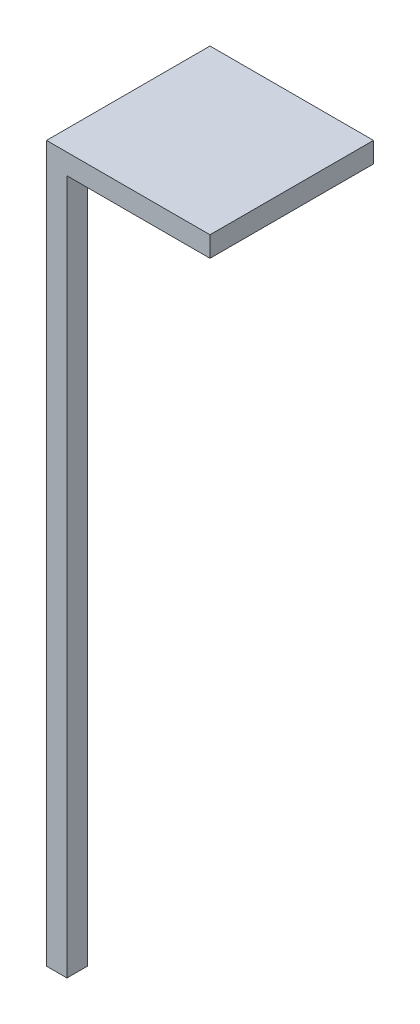
ISO-10303-21;
HEADER;
FILE_DESCRIPTION(('STEP AP214'),'2;1');
FILE_NAME('part.step','',(''),(''),'','','');
FILE_SCHEMA(('AUTOMOTIVE_DESIGN { 1 0 10303 214 1 1 1 1 }'));
ENDSEC;
DATA;
#1=APPLICATION_CONTEXT('core data for automotive mechanical design processes');
#2=APPLICATION_PROTOCOL_DEFINITION('international standard','automotive_design',2000,#1);
#3=PRODUCT_CONTEXT('',#1,'mechanical');
#4=PRODUCT('Part','Part','',(#3));
#5=PRODUCT_RELATED_PRODUCT_CATEGORY('part','',(#4));
#6=PRODUCT_DEFINITION_FORMATION('','',#4);
#7=PRODUCT_DEFINITION_CONTEXT('part definition',#1,'design');
#8=PRODUCT_DEFINITION('design','',#6,#7);
#9=PRODUCT_DEFINITION_SHAPE('','',#8);
#10=(LENGTH_UNIT() NAMED_UNIT(*) SI_UNIT(.MILLI.,.METRE.));
#11=(NAMED_UNIT(*) PLANE_ANGLE_UNIT() SI_UNIT($,.RADIAN.));
#12=(NAMED_UNIT(*) SI_UNIT($,.STERADIAN.) SOLID_ANGLE_UNIT());
#13=UNCERTAINTY_MEASURE_WITH_UNIT(LENGTH_MEASURE(1.E-05),#10,'distance_accuracy_value','');
#14=(GEOMETRIC_REPRESENTATION_CONTEXT(3) GLOBAL_UNCERTAINTY_ASSIGNED_CONTEXT((#13)) GLOBAL_UNIT_ASSIGNED_CONTEXT((#10,
#11,#12)) REPRESENTATION_CONTEXT('',''));
#15=CARTESIAN_POINT('',(0.,0.,0.));
#16=DIRECTION('',(0.,0.,1.));
#17=DIRECTION('',(1.,0.,0.));
#18=AXIS2_PLACEMENT_3D('',#15,#16,#17);
#19=CARTESIAN_POINT('',(0.,340.,0.));
#20=DIRECTION('',(1.,0.,0.));
#21=DIRECTION('',(0.,0.,-1.));
#22=AXIS2_PLACEMENT_3D('',#19,#20,#21);
#23=PLANE('',#22);
#24=DIRECTION('',(0.,0.,1.));
#25=VECTOR('',#24,1.);
#26=CARTESIAN_POINT('',(0.,0.,0.));
#27=LINE('',#26,#25);
#28=CARTESIAN_POINT('',(0.,0.,-10.));
#29=VERTEX_POINT('',#28);
#30=CARTESIAN_POINT('',(0.,0.,0.));
#31=VERTEX_POINT('',#30);
#32=EDGE_CURVE('E82',#29,#31,#27,.T.);
#33=ORIENTED_EDGE('',*,*,#32,.T.);
#34=DIRECTION('',(0.,-1.,0.));
#35=VECTOR('',#34,1.);
#36=CARTESIAN_POINT('',(0.,340.,0.));
#37=LINE('',#36,#35);
#38=CARTESIAN_POINT('',(0.,350.,0.));
#39=VERTEX_POINT('',#38);
#40=EDGE_CURVE('E11',#39,#31,#37,.T.);
#41=ORIENTED_EDGE('',*,*,#40,.F.);
#42=DIRECTION('',(0.,0.,1.));
#43=VECTOR('',#42,1.);
#44=CARTESIAN_POINT('',(0.,350.,0.));
#45=LINE('',#44,#43);
#46=CARTESIAN_POINT('',(0.,350.,-80.));
#47=VERTEX_POINT('',#46);
#48=EDGE_CURVE('E126',#47,#39,#45,.T.);
#49=ORIENTED_EDGE('',*,*,#48,.F.);
#50=DIRECTION('',(0.,-1.,0.));
#51=VECTOR('',#50,1.);
#52=CARTESIAN_POINT('',(0.,350.,-80.));
#53=LINE('',#52,#51);
#54=CARTESIAN_POINT('',(0.,340.,-80.));
#55=VERTEX_POINT('',#54);
#56=EDGE_CURVE('E156',#47,#55,#53,.T.);
#57=ORIENTED_EDGE('',*,*,#56,.T.);
#58=DIRECTION('',(0.,0.,1.));
#59=VECTOR('',#58,1.);
#60=CARTESIAN_POINT('',(0.,340.,0.));
#61=LINE('',#60,#59);
#62=CARTESIAN_POINT('',(0.,340.,-10.));
#63=VERTEX_POINT('',#62);
#64=EDGE_CURVE('E85',#55,#63,#61,.T.);
#65=ORIENTED_EDGE('',*,*,#64,.T.);
#66=DIRECTION('',(0.,-1.,0.));
#67=VECTOR('',#66,1.);
#68=CARTESIAN_POINT('',(0.,340.,-10.));
#69=LINE('',#68,#67);
#70=EDGE_CURVE('E72',#63,#29,#69,.T.);
#71=ORIENTED_EDGE('',*,*,#70,.T.);
#72=EDGE_LOOP('',(#33,#41,#49,#57,#65,#71));
#73=FACE_BOUND('',#72,.T.);
#74=ADVANCED_FACE('F31',(#73),#23,.F.);
#75=CARTESIAN_POINT('',(0.,340.,0.));
#76=DIRECTION('',(0.,0.,-1.));
#77=DIRECTION('',(-1.,0.,0.));
#78=AXIS2_PLACEMENT_3D('',#75,#76,#77);
#79=PLANE('',#78);
#80=DIRECTION('',(1.,0.,0.));
#81=VECTOR('',#80,1.);
#82=CARTESIAN_POINT('',(0.,0.,0.));
#83=LINE('',#82,#81);
#84=CARTESIAN_POINT('',(10.,0.,0.));
#85=VERTEX_POINT('',#84);
#86=EDGE_CURVE('E89',#31,#85,#83,.T.);
#87=ORIENTED_EDGE('',*,*,#86,.T.);
#88=DIRECTION('',(0.,-1.,0.));
#89=VECTOR('',#88,1.);
#90=CARTESIAN_POINT('',(10.,340.,0.));
#91=LINE('',#90,#89);
#92=CARTESIAN_POINT('',(10.,340.,0.));
#93=VERTEX_POINT('',#92);
#94=EDGE_CURVE('E40',#93,#85,#91,.T.);
#95=ORIENTED_EDGE('',*,*,#94,.F.);
#96=DIRECTION('',(1.,0.,0.));
#97=VECTOR('',#96,1.);
#98=CARTESIAN_POINT('',(0.,340.,0.));
#99=LINE('',#98,#97);
#100=CARTESIAN_POINT('',(80.,340.,0.));
#101=VERTEX_POINT('',#100);
#102=EDGE_CURVE('E113',#93,#101,#99,.T.);
#103=ORIENTED_EDGE('',*,*,#102,.T.);
#104=DIRECTION('',(0.,-1.,0.));
#105=VECTOR('',#104,1.);
#106=CARTESIAN_POINT('',(80.,350.,0.));
#107=LINE('',#106,#105);
#108=CARTESIAN_POINT('',(80.,350.,0.));
#109=VERTEX_POINT('',#108);
#110=EDGE_CURVE('E90',#109,#101,#107,.T.);
#111=ORIENTED_EDGE('',*,*,#110,.F.);
#112=DIRECTION('',(1.,0.,0.));
#113=VECTOR('',#112,1.);
#114=CARTESIAN_POINT('',(0.,350.,0.));
#115=LINE('',#114,#113);
#116=EDGE_CURVE('E122',#39,#109,#115,.T.);
#117=ORIENTED_EDGE('',*,*,#116,.F.);
#118=ORIENTED_EDGE('',*,*,#40,.T.);
#119=EDGE_LOOP('',(#87,#95,#103,#111,#117,#118));
#120=FACE_BOUND('',#119,.T.);
#121=ADVANCED_FACE('F116',(#120),#79,.F.);
#122=CARTESIAN_POINT('',(10.,340.,0.));
#123=DIRECTION('',(-1.,0.,0.));
#124=DIRECTION('',(0.,0.,1.));
#125=AXIS2_PLACEMENT_3D('',#122,#123,#124);
#126=PLANE('',#125);
#127=DIRECTION('',(0.,0.,-1.));
#128=VECTOR('',#127,1.);
#129=CARTESIAN_POINT('',(10.,0.,0.));
#130=LINE('',#129,#128);
#131=CARTESIAN_POINT('',(10.,0.,-10.));
#132=VERTEX_POINT('',#131);
#133=EDGE_CURVE('E64',#85,#132,#130,.T.);
#134=ORIENTED_EDGE('',*,*,#133,.T.);
#135=DIRECTION('',(0.,-1.,0.));
#136=VECTOR('',#135,1.);
#137=CARTESIAN_POINT('',(10.,340.,-10.));
#138=LINE('',#137,#136);
#139=CARTESIAN_POINT('',(10.,340.,-10.));
#140=VERTEX_POINT('',#139);
#141=EDGE_CURVE('E49',#140,#132,#138,.T.);
#142=ORIENTED_EDGE('',*,*,#141,.F.);
#143=DIRECTION('',(0.,0.,-1.));
#144=VECTOR('',#143,1.);
#145=CARTESIAN_POINT('',(10.,340.,0.));
#146=LINE('',#145,#144);
#147=EDGE_CURVE('E76',#93,#140,#146,.T.);
#148=ORIENTED_EDGE('',*,*,#147,.F.);
#149=ORIENTED_EDGE('',*,*,#94,.T.);
#150=EDGE_LOOP('',(#134,#142,#148,#149));
#151=FACE_BOUND('',#150,.T.);
#152=ADVANCED_FACE('F114',(#151),#126,.F.);
#153=CARTESIAN_POINT('',(0.,340.,-10.));
#154=DIRECTION('',(0.,0.,1.));
#155=DIRECTION('',(1.,0.,0.));
#156=AXIS2_PLACEMENT_3D('',#153,#154,#155);
#157=PLANE('',#156);
#158=DIRECTION('',(-1.,0.,0.));
#159=VECTOR('',#158,1.);
#160=CARTESIAN_POINT('',(0.,0.,-10.));
#161=LINE('',#160,#159);
#162=EDGE_CURVE('E69',#132,#29,#161,.T.);
#163=ORIENTED_EDGE('',*,*,#162,.T.);
#164=ORIENTED_EDGE('',*,*,#70,.F.);
#165=DIRECTION('',(-1.,0.,0.));
#166=VECTOR('',#165,1.);
#167=CARTESIAN_POINT('',(0.,340.,-10.));
#168=LINE('',#167,#166);
#169=EDGE_CURVE('E86',#140,#63,#168,.T.);
#170=ORIENTED_EDGE('',*,*,#169,.F.);
#171=ORIENTED_EDGE('',*,*,#141,.T.);
#172=EDGE_LOOP('',(#163,#164,#170,#171));
#173=FACE_BOUND('',#172,.T.);
#174=ADVANCED_FACE('F71',(#173),#157,.F.);
#175=CARTESIAN_POINT('',(0.,0.,-10.));
#176=DIRECTION('',(0.,-1.,0.));
#177=DIRECTION('',(0.,0.,-1.));
#178=AXIS2_PLACEMENT_3D('',#175,#176,#177);
#179=PLANE('',#178);
#180=ORIENTED_EDGE('',*,*,#32,.F.);
#181=ORIENTED_EDGE('',*,*,#162,.F.);
#182=ORIENTED_EDGE('',*,*,#133,.F.);
#183=ORIENTED_EDGE('',*,*,#86,.F.);
#184=EDGE_LOOP('',(#180,#181,#182,#183));
#185=FACE_BOUND('',#184,.T.);
#186=ADVANCED_FACE('F88',(#185),#179,.T.);
#187=CARTESIAN_POINT('',(80.,350.,0.));
#188=DIRECTION('',(-1.,0.,0.));
#189=DIRECTION('',(0.,0.,1.));
#190=AXIS2_PLACEMENT_3D('',#187,#188,#189);
#191=PLANE('',#190);
#192=DIRECTION('',(0.,0.,-1.));
#193=VECTOR('',#192,1.);
#194=CARTESIAN_POINT('',(80.,340.,0.));
#195=LINE('',#194,#193);
#196=CARTESIAN_POINT('',(80.,340.,-80.));
#197=VERTEX_POINT('',#196);
#198=EDGE_CURVE('E144',#101,#197,#195,.T.);
#199=ORIENTED_EDGE('',*,*,#198,.T.);
#200=DIRECTION('',(0.,-1.,0.));
#201=VECTOR('',#200,1.);
#202=CARTESIAN_POINT('',(80.,350.,-80.));
#203=LINE('',#202,#201);
#204=CARTESIAN_POINT('',(80.,350.,-80.));
#205=VERTEX_POINT('',#204);
#206=EDGE_CURVE('E94',#205,#197,#203,.T.);
#207=ORIENTED_EDGE('',*,*,#206,.F.);
#208=DIRECTION('',(0.,0.,-1.));
#209=VECTOR('',#208,1.);
#210=CARTESIAN_POINT('',(80.,350.,0.));
#211=LINE('',#210,#209);
#212=EDGE_CURVE('E168',#109,#205,#211,.T.);
#213=ORIENTED_EDGE('',*,*,#212,.F.);
#214=ORIENTED_EDGE('',*,*,#110,.T.);
#215=EDGE_LOOP('',(#199,#207,#213,#214));
#216=FACE_BOUND('',#215,.T.);
#217=ADVANCED_FACE('F146',(#216),#191,.F.);
#218=CARTESIAN_POINT('',(0.,350.,-80.));
#219=DIRECTION('',(0.,0.,1.));
#220=DIRECTION('',(1.,0.,0.));
#221=AXIS2_PLACEMENT_3D('',#218,#219,#220);
#222=PLANE('',#221);
#223=DIRECTION('',(-1.,0.,0.));
#224=VECTOR('',#223,1.);
#225=CARTESIAN_POINT('',(0.,340.,-80.));
#226=LINE('',#225,#224);
#227=EDGE_CURVE('E150',#197,#55,#226,.T.);
#228=ORIENTED_EDGE('',*,*,#227,.T.);
#229=ORIENTED_EDGE('',*,*,#56,.F.);
#230=DIRECTION('',(-1.,0.,0.));
#231=VECTOR('',#230,1.);
#232=CARTESIAN_POINT('',(0.,350.,-80.));
#233=LINE('',#232,#231);
#234=EDGE_CURVE('E155',#205,#47,#233,.T.);
#235=ORIENTED_EDGE('',*,*,#234,.F.);
#236=ORIENTED_EDGE('',*,*,#206,.T.);
#237=EDGE_LOOP('',(#228,#229,#235,#236));
#238=FACE_BOUND('',#237,.T.);
#239=ADVANCED_FACE('F153',(#238),#222,.F.);
#240=CARTESIAN_POINT('',(0.,350.,-80.));
#241=DIRECTION('',(0.,-1.,0.));
#242=DIRECTION('',(0.,0.,-1.));
#243=AXIS2_PLACEMENT_3D('',#240,#241,#242);
#244=PLANE('',#243);
#245=ORIENTED_EDGE('',*,*,#48,.T.);
#246=ORIENTED_EDGE('',*,*,#116,.T.);
#247=ORIENTED_EDGE('',*,*,#212,.T.);
#248=ORIENTED_EDGE('',*,*,#234,.T.);
#249=EDGE_LOOP('',(#245,#246,#247,#248));
#250=FACE_BOUND('',#249,.T.);
#251=ADVANCED_FACE('F171',(#250),#244,.F.);
#252=CARTESIAN_POINT('',(0.,340.,-80.));
#253=DIRECTION('',(0.,-1.,0.));
#254=DIRECTION('',(0.,0.,-1.));
#255=AXIS2_PLACEMENT_3D('',#252,#253,#254);
#256=PLANE('',#255);
#257=ORIENTED_EDGE('',*,*,#102,.F.);
#258=ORIENTED_EDGE('',*,*,#147,.T.);
#259=ORIENTED_EDGE('',*,*,#169,.T.);
#260=ORIENTED_EDGE('',*,*,#64,.F.);
#261=ORIENTED_EDGE('',*,*,#227,.F.);
#262=ORIENTED_EDGE('',*,*,#198,.F.);
#263=EDGE_LOOP('',(#257,#258,#259,#260,#261,#262));
#264=FACE_BOUND('',#263,.T.);
#265=ADVANCED_FACE('F110',(#264),#256,.T.);
#266=CLOSED_SHELL('',(#74,#121,#152,#174,#186,#217,#239,#251,#265));
#267=MANIFOLD_SOLID_BREP('B2',#266);
#268=ADVANCED_BREP_SHAPE_REPRESENTATION('',(#18,#267),#14);
#269=SHAPE_DEFINITION_REPRESENTATION(#9,#268);
ENDSEC;
END-ISO-10303-21;
